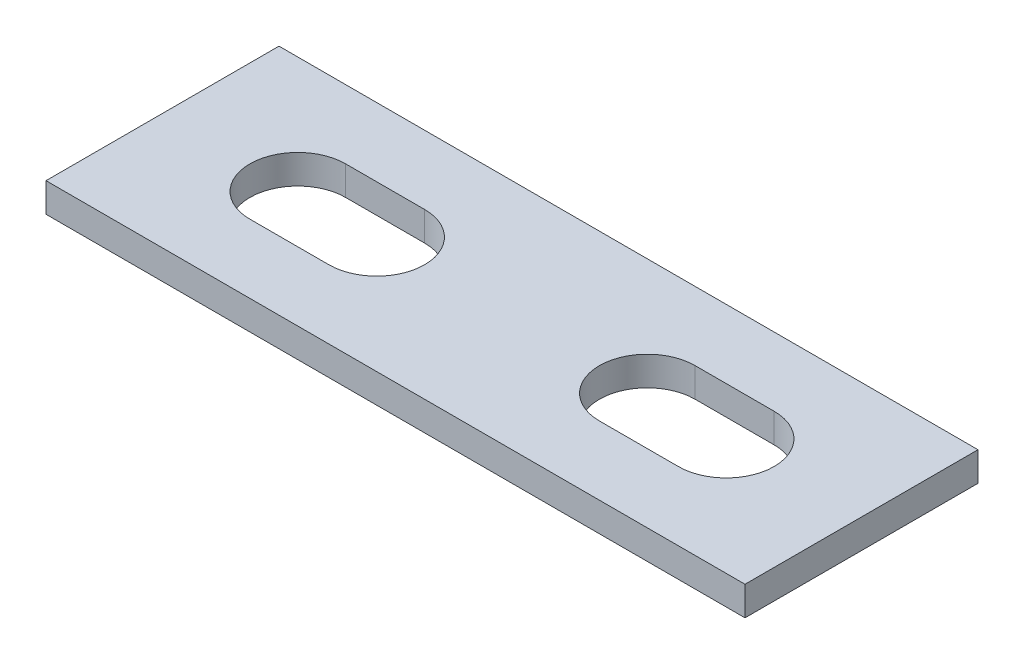
ISO-10303-21;
HEADER;
FILE_DESCRIPTION(('STEP AP214'),'2;1');
FILE_NAME('part.step','',(''),(''),'','','');
FILE_SCHEMA(('AUTOMOTIVE_DESIGN { 1 0 10303 214 1 1 1 1 }'));
ENDSEC;
DATA;
#1=APPLICATION_CONTEXT('core data for automotive mechanical design processes');
#2=APPLICATION_PROTOCOL_DEFINITION('international standard','automotive_design',2000,#1);
#3=PRODUCT_CONTEXT('',#1,'mechanical');
#4=PRODUCT('Part','Part','',(#3));
#5=PRODUCT_RELATED_PRODUCT_CATEGORY('part','',(#4));
#6=PRODUCT_DEFINITION_FORMATION('','',#4);
#7=PRODUCT_DEFINITION_CONTEXT('part definition',#1,'design');
#8=PRODUCT_DEFINITION('design','',#6,#7);
#9=PRODUCT_DEFINITION_SHAPE('','',#8);
#10=(LENGTH_UNIT() NAMED_UNIT(*) SI_UNIT(.MILLI.,.METRE.));
#11=(NAMED_UNIT(*) PLANE_ANGLE_UNIT() SI_UNIT($,.RADIAN.));
#12=(NAMED_UNIT(*) SI_UNIT($,.STERADIAN.) SOLID_ANGLE_UNIT());
#13=UNCERTAINTY_MEASURE_WITH_UNIT(LENGTH_MEASURE(1.E-05),#10,'distance_accuracy_value','');
#14=(GEOMETRIC_REPRESENTATION_CONTEXT(3) GLOBAL_UNCERTAINTY_ASSIGNED_CONTEXT((#13)) GLOBAL_UNIT_ASSIGNED_CONTEXT((#10,
#11,#12)) REPRESENTATION_CONTEXT('',''));
#15=CARTESIAN_POINT('',(0.,0.,0.));
#16=DIRECTION('',(0.,0.,1.));
#17=DIRECTION('',(1.,0.,0.));
#18=AXIS2_PLACEMENT_3D('',#15,#16,#17);
#19=CARTESIAN_POINT('',(0.,3.175,0.));
#20=DIRECTION('',(0.,1.,0.));
#21=DIRECTION('',(0.,0.,1.));
#22=AXIS2_PLACEMENT_3D('',#19,#20,#21);
#23=PLANE('',#22);
#24=DIRECTION('',(0.,0.,-1.));
#25=VECTOR('',#24,1.);
#26=CARTESIAN_POINT('',(38.1,3.175,-12.7));
#27=LINE('',#26,#25);
#28=CARTESIAN_POINT('',(38.1,3.175,12.7));
#29=VERTEX_POINT('',#28);
#30=CARTESIAN_POINT('',(38.1,3.175,-12.7));
#31=VERTEX_POINT('',#30);
#32=EDGE_CURVE('E193',#29,#31,#27,.T.);
#33=ORIENTED_EDGE('',*,*,#32,.T.);
#34=DIRECTION('',(-1.,0.,0.));
#35=VECTOR('',#34,1.);
#36=CARTESIAN_POINT('',(-38.1,3.175,-12.7));
#37=LINE('',#36,#35);
#38=CARTESIAN_POINT('',(-38.1,3.175,-12.7));
#39=VERTEX_POINT('',#38);
#40=EDGE_CURVE('E196',#31,#39,#37,.T.);
#41=ORIENTED_EDGE('',*,*,#40,.T.);
#42=DIRECTION('',(0.,0.,1.));
#43=VECTOR('',#42,1.);
#44=CARTESIAN_POINT('',(-38.1,3.175,-12.7));
#45=LINE('',#44,#43);
#46=CARTESIAN_POINT('',(-38.1,3.175,12.7));
#47=VERTEX_POINT('',#46);
#48=EDGE_CURVE('E199',#39,#47,#45,.T.);
#49=ORIENTED_EDGE('',*,*,#48,.T.);
#50=DIRECTION('',(1.,0.,0.));
#51=VECTOR('',#50,1.);
#52=CARTESIAN_POINT('',(-38.1,3.175,12.7));
#53=LINE('',#52,#51);
#54=EDGE_CURVE('E201',#47,#29,#53,.T.);
#55=ORIENTED_EDGE('',*,*,#54,.T.);
#56=EDGE_LOOP('',(#33,#41,#49,#55));
#57=FACE_BOUND('',#56,.T.);
#58=DIRECTION('',(1.,0.,0.));
#59=VECTOR('',#58,1.);
#60=CARTESIAN_POINT('',(-23.3553,3.175,5.2197));
#61=LINE('',#60,#59);
#62=CARTESIAN_POINT('',(-23.3553,3.175,5.2197));
#63=VERTEX_POINT('',#62);
#64=CARTESIAN_POINT('',(-14.7447,3.175,5.21970000000001));
#65=VERTEX_POINT('',#64);
#66=EDGE_CURVE('E164',#63,#65,#61,.T.);
#67=ORIENTED_EDGE('',*,*,#66,.F.);
#68=CARTESIAN_POINT('',(-23.3553,3.175,0.));
#69=DIRECTION('',(0.,1.,0.));
#70=DIRECTION('',(0.,0.,1.));
#71=AXIS2_PLACEMENT_3D('',#68,#69,#70);
#72=CIRCLE('',#71,5.2197);
#73=CARTESIAN_POINT('',(-23.3553,3.175,-5.2197));
#74=VERTEX_POINT('',#73);
#75=EDGE_CURVE('E162',#74,#63,#72,.T.);
#76=ORIENTED_EDGE('',*,*,#75,.F.);
#77=DIRECTION('',(-1.,0.,0.));
#78=VECTOR('',#77,1.);
#79=CARTESIAN_POINT('',(-23.3553,3.175,-5.2197));
#80=LINE('',#79,#78);
#81=CARTESIAN_POINT('',(-14.7447,3.175,-5.2197));
#82=VERTEX_POINT('',#81);
#83=EDGE_CURVE('E170',#82,#74,#80,.T.);
#84=ORIENTED_EDGE('',*,*,#83,.F.);
#85=CARTESIAN_POINT('',(-14.7447,3.175,0.));
#86=DIRECTION('',(0.,1.,0.));
#87=DIRECTION('',(0.,0.,1.));
#88=AXIS2_PLACEMENT_3D('',#85,#86,#87);
#89=CIRCLE('',#88,5.2197);
#90=EDGE_CURVE('E167',#65,#82,#89,.T.);
#91=ORIENTED_EDGE('',*,*,#90,.F.);
#92=EDGE_LOOP('',(#67,#76,#84,#91));
#93=FACE_BOUND('',#92,.T.);
#94=DIRECTION('',(-1.,0.,0.));
#95=VECTOR('',#94,1.);
#96=CARTESIAN_POINT('',(23.3553,3.175,-5.2197));
#97=LINE('',#96,#95);
#98=CARTESIAN_POINT('',(23.3553,3.175,-5.2197));
#99=VERTEX_POINT('',#98);
#100=CARTESIAN_POINT('',(14.7447,3.175,-5.2197));
#101=VERTEX_POINT('',#100);
#102=EDGE_CURVE('E134',#99,#101,#97,.T.);
#103=ORIENTED_EDGE('',*,*,#102,.F.);
#104=CARTESIAN_POINT('',(23.3553,3.175,0.));
#105=DIRECTION('',(0.,1.,0.));
#106=DIRECTION('',(0.,0.,-1.));
#107=AXIS2_PLACEMENT_3D('',#104,#105,#106);
#108=CIRCLE('',#107,5.2197);
#109=CARTESIAN_POINT('',(23.3553,3.175,5.2197));
#110=VERTEX_POINT('',#109);
#111=EDGE_CURVE('E126',#110,#99,#108,.T.);
#112=ORIENTED_EDGE('',*,*,#111,.F.);
#113=DIRECTION('',(1.,0.,0.));
#114=VECTOR('',#113,1.);
#115=CARTESIAN_POINT('',(23.3553,3.175,5.2197));
#116=LINE('',#115,#114);
#117=CARTESIAN_POINT('',(14.7447,3.175,5.2197));
#118=VERTEX_POINT('',#117);
#119=EDGE_CURVE('E148',#118,#110,#116,.T.);
#120=ORIENTED_EDGE('',*,*,#119,.F.);
#121=CARTESIAN_POINT('',(14.7447,3.175,0.));
#122=DIRECTION('',(0.,1.,0.));
#123=DIRECTION('',(0.,0.,-1.));
#124=AXIS2_PLACEMENT_3D('',#121,#122,#123);
#125=CIRCLE('',#124,5.2197);
#126=EDGE_CURVE('E146',#101,#118,#125,.T.);
#127=ORIENTED_EDGE('',*,*,#126,.F.);
#128=EDGE_LOOP('',(#103,#112,#120,#127));
#129=FACE_BOUND('',#128,.T.);
#130=ADVANCED_FACE('F37',(#57,#93,#129),#23,.T.);
#131=CARTESIAN_POINT('',(0.,0.,0.));
#132=DIRECTION('',(0.,1.,0.));
#133=DIRECTION('',(0.,0.,1.));
#134=AXIS2_PLACEMENT_3D('',#131,#132,#133);
#135=PLANE('',#134);
#136=CARTESIAN_POINT('',(-23.3553,0.,0.));
#137=DIRECTION('',(0.,1.,0.));
#138=DIRECTION('',(0.,0.,1.));
#139=AXIS2_PLACEMENT_3D('',#136,#137,#138);
#140=CIRCLE('',#139,5.2197);
#141=CARTESIAN_POINT('',(-23.3553,0.,-5.2197));
#142=VERTEX_POINT('',#141);
#143=CARTESIAN_POINT('',(-23.3553,0.,5.2197));
#144=VERTEX_POINT('',#143);
#145=EDGE_CURVE('E142',#142,#144,#140,.T.);
#146=ORIENTED_EDGE('',*,*,#145,.T.);
#147=DIRECTION('',(1.,0.,0.));
#148=VECTOR('',#147,1.);
#149=CARTESIAN_POINT('',(-23.3553,0.,5.2197));
#150=LINE('',#149,#148);
#151=CARTESIAN_POINT('',(-14.7447,0.,5.21970000000001));
#152=VERTEX_POINT('',#151);
#153=EDGE_CURVE('E175',#144,#152,#150,.T.);
#154=ORIENTED_EDGE('',*,*,#153,.T.);
#155=CARTESIAN_POINT('',(-14.7447,0.,0.));
#156=DIRECTION('',(0.,1.,0.));
#157=DIRECTION('',(0.,0.,1.));
#158=AXIS2_PLACEMENT_3D('',#155,#156,#157);
#159=CIRCLE('',#158,5.2197);
#160=CARTESIAN_POINT('',(-14.7447,0.,-5.2197));
#161=VERTEX_POINT('',#160);
#162=EDGE_CURVE('E178',#152,#161,#159,.T.);
#163=ORIENTED_EDGE('',*,*,#162,.T.);
#164=DIRECTION('',(-1.,0.,0.));
#165=VECTOR('',#164,1.);
#166=CARTESIAN_POINT('',(-23.3553,0.,-5.2197));
#167=LINE('',#166,#165);
#168=EDGE_CURVE('E165',#161,#142,#167,.T.);
#169=ORIENTED_EDGE('',*,*,#168,.T.);
#170=EDGE_LOOP('',(#146,#154,#163,#169));
#171=FACE_BOUND('',#170,.T.);
#172=DIRECTION('',(0.,0.,-1.));
#173=VECTOR('',#172,1.);
#174=CARTESIAN_POINT('',(38.1,0.,-12.7));
#175=LINE('',#174,#173);
#176=CARTESIAN_POINT('',(38.1,0.,12.7));
#177=VERTEX_POINT('',#176);
#178=CARTESIAN_POINT('',(38.1,0.,-12.7));
#179=VERTEX_POINT('',#178);
#180=EDGE_CURVE('E192',#177,#179,#175,.T.);
#181=ORIENTED_EDGE('',*,*,#180,.F.);
#182=DIRECTION('',(1.,0.,0.));
#183=VECTOR('',#182,1.);
#184=CARTESIAN_POINT('',(-38.1,0.,12.7));
#185=LINE('',#184,#183);
#186=CARTESIAN_POINT('',(-38.1,0.,12.7));
#187=VERTEX_POINT('',#186);
#188=EDGE_CURVE('E197',#187,#177,#185,.T.);
#189=ORIENTED_EDGE('',*,*,#188,.F.);
#190=DIRECTION('',(0.,0.,1.));
#191=VECTOR('',#190,1.);
#192=CARTESIAN_POINT('',(-38.1,0.,-12.7));
#193=LINE('',#192,#191);
#194=CARTESIAN_POINT('',(-38.1,0.,-12.7));
#195=VERTEX_POINT('',#194);
#196=EDGE_CURVE('E208',#195,#187,#193,.T.);
#197=ORIENTED_EDGE('',*,*,#196,.F.);
#198=DIRECTION('',(-1.,0.,0.));
#199=VECTOR('',#198,1.);
#200=CARTESIAN_POINT('',(-38.1,0.,-12.7));
#201=LINE('',#200,#199);
#202=EDGE_CURVE('E206',#179,#195,#201,.T.);
#203=ORIENTED_EDGE('',*,*,#202,.F.);
#204=EDGE_LOOP('',(#181,#189,#197,#203));
#205=FACE_BOUND('',#204,.T.);
#206=CARTESIAN_POINT('',(23.3553,0.,0.));
#207=DIRECTION('',(0.,1.,0.));
#208=DIRECTION('',(0.,0.,-1.));
#209=AXIS2_PLACEMENT_3D('',#206,#207,#208);
#210=CIRCLE('',#209,5.2197);
#211=CARTESIAN_POINT('',(23.3553,0.,5.2197));
#212=VERTEX_POINT('',#211);
#213=CARTESIAN_POINT('',(23.3553,0.,-5.2197));
#214=VERTEX_POINT('',#213);
#215=EDGE_CURVE('E60',#212,#214,#210,.T.);
#216=ORIENTED_EDGE('',*,*,#215,.T.);
#217=DIRECTION('',(-1.,0.,0.));
#218=VECTOR('',#217,1.);
#219=CARTESIAN_POINT('',(23.3553,0.,-5.2197));
#220=LINE('',#219,#218);
#221=CARTESIAN_POINT('',(14.7447,0.,-5.2197));
#222=VERTEX_POINT('',#221);
#223=EDGE_CURVE('E141',#214,#222,#220,.T.);
#224=ORIENTED_EDGE('',*,*,#223,.T.);
#225=CARTESIAN_POINT('',(14.7447,0.,0.));
#226=DIRECTION('',(0.,1.,0.));
#227=DIRECTION('',(0.,0.,-1.));
#228=AXIS2_PLACEMENT_3D('',#225,#226,#227);
#229=CIRCLE('',#228,5.2197);
#230=CARTESIAN_POINT('',(14.7447,0.,5.2197));
#231=VERTEX_POINT('',#230);
#232=EDGE_CURVE('E154',#222,#231,#229,.T.);
#233=ORIENTED_EDGE('',*,*,#232,.T.);
#234=DIRECTION('',(1.,0.,0.));
#235=VECTOR('',#234,1.);
#236=CARTESIAN_POINT('',(23.3553,0.,5.2197));
#237=LINE('',#236,#235);
#238=EDGE_CURVE('E135',#231,#212,#237,.T.);
#239=ORIENTED_EDGE('',*,*,#238,.T.);
#240=EDGE_LOOP('',(#216,#224,#233,#239));
#241=FACE_BOUND('',#240,.T.);
#242=ADVANCED_FACE('F226',(#171,#205,#241),#135,.F.);
#243=CARTESIAN_POINT('',(38.1,3.175,-12.7));
#244=DIRECTION('',(-1.,0.,0.));
#245=DIRECTION('',(0.,0.,1.));
#246=AXIS2_PLACEMENT_3D('',#243,#244,#245);
#247=PLANE('',#246);
#248=ORIENTED_EDGE('',*,*,#180,.T.);
#249=DIRECTION('',(0.,-1.,0.));
#250=VECTOR('',#249,1.);
#251=CARTESIAN_POINT('',(38.1,3.175,-12.7));
#252=LINE('',#251,#250);
#253=EDGE_CURVE('E11',#31,#179,#252,.T.);
#254=ORIENTED_EDGE('',*,*,#253,.F.);
#255=ORIENTED_EDGE('',*,*,#32,.F.);
#256=DIRECTION('',(0.,-1.,0.));
#257=VECTOR('',#256,1.);
#258=CARTESIAN_POINT('',(38.1,3.175,12.7));
#259=LINE('',#258,#257);
#260=EDGE_CURVE('E203',#29,#177,#259,.T.);
#261=ORIENTED_EDGE('',*,*,#260,.T.);
#262=EDGE_LOOP('',(#248,#254,#255,#261));
#263=FACE_BOUND('',#262,.T.);
#264=ADVANCED_FACE('F39',(#263),#247,.F.);
#265=CARTESIAN_POINT('',(-38.1,3.175,-12.7));
#266=DIRECTION('',(0.,0.,1.));
#267=DIRECTION('',(1.,0.,0.));
#268=AXIS2_PLACEMENT_3D('',#265,#266,#267);
#269=PLANE('',#268);
#270=ORIENTED_EDGE('',*,*,#202,.T.);
#271=DIRECTION('',(0.,-1.,0.));
#272=VECTOR('',#271,1.);
#273=CARTESIAN_POINT('',(-38.1,3.175,-12.7));
#274=LINE('',#273,#272);
#275=EDGE_CURVE('E45',#39,#195,#274,.T.);
#276=ORIENTED_EDGE('',*,*,#275,.F.);
#277=ORIENTED_EDGE('',*,*,#40,.F.);
#278=ORIENTED_EDGE('',*,*,#253,.T.);
#279=EDGE_LOOP('',(#270,#276,#277,#278));
#280=FACE_BOUND('',#279,.T.);
#281=ADVANCED_FACE('F237',(#280),#269,.F.);
#282=CARTESIAN_POINT('',(-38.1,3.175,-12.7));
#283=DIRECTION('',(1.,0.,0.));
#284=DIRECTION('',(0.,0.,-1.));
#285=AXIS2_PLACEMENT_3D('',#282,#283,#284);
#286=PLANE('',#285);
#287=ORIENTED_EDGE('',*,*,#196,.T.);
#288=DIRECTION('',(0.,-1.,0.));
#289=VECTOR('',#288,1.);
#290=CARTESIAN_POINT('',(-38.1,3.175,12.7));
#291=LINE('',#290,#289);
#292=EDGE_CURVE('E213',#47,#187,#291,.T.);
#293=ORIENTED_EDGE('',*,*,#292,.F.);
#294=ORIENTED_EDGE('',*,*,#48,.F.);
#295=ORIENTED_EDGE('',*,*,#275,.T.);
#296=EDGE_LOOP('',(#287,#293,#294,#295));
#297=FACE_BOUND('',#296,.T.);
#298=ADVANCED_FACE('F220',(#297),#286,.F.);
#299=CARTESIAN_POINT('',(-38.1,3.175,12.7));
#300=DIRECTION('',(0.,0.,-1.));
#301=DIRECTION('',(-1.,0.,0.));
#302=AXIS2_PLACEMENT_3D('',#299,#300,#301);
#303=PLANE('',#302);
#304=ORIENTED_EDGE('',*,*,#188,.T.);
#305=ORIENTED_EDGE('',*,*,#260,.F.);
#306=ORIENTED_EDGE('',*,*,#54,.F.);
#307=ORIENTED_EDGE('',*,*,#292,.T.);
#308=EDGE_LOOP('',(#304,#305,#306,#307));
#309=FACE_BOUND('',#308,.T.);
#310=ADVANCED_FACE('F230',(#309),#303,.F.);
#311=CARTESIAN_POINT('',(-23.3553,3.175,0.));
#312=DIRECTION('',(0.,-1.,0.));
#313=DIRECTION('',(0.,0.,-1.));
#314=AXIS2_PLACEMENT_3D('',#311,#312,#313);
#315=CYLINDRICAL_SURFACE('',#314,5.2197);
#316=ORIENTED_EDGE('',*,*,#145,.F.);
#317=DIRECTION('',(0.,-1.,0.));
#318=VECTOR('',#317,1.);
#319=CARTESIAN_POINT('',(-23.3553,3.175,-5.2197));
#320=LINE('',#319,#318);
#321=EDGE_CURVE('E172',#74,#142,#320,.T.);
#322=ORIENTED_EDGE('',*,*,#321,.F.);
#323=ORIENTED_EDGE('',*,*,#75,.T.);
#324=DIRECTION('',(0.,-1.,0.));
#325=VECTOR('',#324,1.);
#326=CARTESIAN_POINT('',(-23.3553,3.175,5.2197));
#327=LINE('',#326,#325);
#328=EDGE_CURVE('E189',#63,#144,#327,.T.);
#329=ORIENTED_EDGE('',*,*,#328,.T.);
#330=EDGE_LOOP('',(#316,#322,#323,#329));
#331=FACE_BOUND('',#330,.T.);
#332=ADVANCED_FACE('F252',(#331),#315,.F.);
#333=CARTESIAN_POINT('',(-23.3553,3.175,5.2197));
#334=DIRECTION('',(0.,0.,-1.));
#335=DIRECTION('',(-1.,0.,0.));
#336=AXIS2_PLACEMENT_3D('',#333,#334,#335);
#337=PLANE('',#336);
#338=ORIENTED_EDGE('',*,*,#153,.F.);
#339=ORIENTED_EDGE('',*,*,#328,.F.);
#340=ORIENTED_EDGE('',*,*,#66,.T.);
#341=DIRECTION('',(0.,-1.,0.));
#342=VECTOR('',#341,1.);
#343=CARTESIAN_POINT('',(-14.7447,3.175,5.21970000000001));
#344=LINE('',#343,#342);
#345=EDGE_CURVE('E187',#65,#152,#344,.T.);
#346=ORIENTED_EDGE('',*,*,#345,.T.);
#347=EDGE_LOOP('',(#338,#339,#340,#346));
#348=FACE_BOUND('',#347,.T.);
#349=ADVANCED_FACE('F259',(#348),#337,.T.);
#350=CARTESIAN_POINT('',(-14.7447,3.175,0.));
#351=DIRECTION('',(0.,-1.,0.));
#352=DIRECTION('',(0.,0.,-1.));
#353=AXIS2_PLACEMENT_3D('',#350,#351,#352);
#354=CYLINDRICAL_SURFACE('',#353,5.2197);
#355=ORIENTED_EDGE('',*,*,#162,.F.);
#356=ORIENTED_EDGE('',*,*,#345,.F.);
#357=ORIENTED_EDGE('',*,*,#90,.T.);
#358=DIRECTION('',(0.,-1.,0.));
#359=VECTOR('',#358,1.);
#360=CARTESIAN_POINT('',(-14.7447,3.175,-5.2197));
#361=LINE('',#360,#359);
#362=EDGE_CURVE('E185',#82,#161,#361,.T.);
#363=ORIENTED_EDGE('',*,*,#362,.T.);
#364=EDGE_LOOP('',(#355,#356,#357,#363));
#365=FACE_BOUND('',#364,.T.);
#366=ADVANCED_FACE('F264',(#365),#354,.F.);
#367=CARTESIAN_POINT('',(-23.3553,3.175,-5.2197));
#368=DIRECTION('',(0.,0.,1.));
#369=DIRECTION('',(1.,0.,0.));
#370=AXIS2_PLACEMENT_3D('',#367,#368,#369);
#371=PLANE('',#370);
#372=ORIENTED_EDGE('',*,*,#168,.F.);
#373=ORIENTED_EDGE('',*,*,#362,.F.);
#374=ORIENTED_EDGE('',*,*,#83,.T.);
#375=ORIENTED_EDGE('',*,*,#321,.T.);
#376=EDGE_LOOP('',(#372,#373,#374,#375));
#377=FACE_BOUND('',#376,.T.);
#378=ADVANCED_FACE('F271',(#377),#371,.T.);
#379=CARTESIAN_POINT('',(23.3553,3.175,0.));
#380=DIRECTION('',(0.,-1.,0.));
#381=DIRECTION('',(0.,0.,-1.));
#382=AXIS2_PLACEMENT_3D('',#379,#380,#381);
#383=CYLINDRICAL_SURFACE('',#382,5.2197);
#384=ORIENTED_EDGE('',*,*,#215,.F.);
#385=DIRECTION('',(0.,-1.,0.));
#386=VECTOR('',#385,1.);
#387=CARTESIAN_POINT('',(23.3553,3.175,5.2197));
#388=LINE('',#387,#386);
#389=EDGE_CURVE('E130',#110,#212,#388,.T.);
#390=ORIENTED_EDGE('',*,*,#389,.F.);
#391=ORIENTED_EDGE('',*,*,#111,.T.);
#392=DIRECTION('',(0.,-1.,0.));
#393=VECTOR('',#392,1.);
#394=CARTESIAN_POINT('',(23.3553,3.175,-5.2197));
#395=LINE('',#394,#393);
#396=EDGE_CURVE('E129',#99,#214,#395,.T.);
#397=ORIENTED_EDGE('',*,*,#396,.T.);
#398=EDGE_LOOP('',(#384,#390,#391,#397));
#399=FACE_BOUND('',#398,.T.);
#400=ADVANCED_FACE('F128',(#399),#383,.F.);
#401=CARTESIAN_POINT('',(23.3553,3.175,-5.2197));
#402=DIRECTION('',(0.,0.,1.));
#403=DIRECTION('',(1.,0.,0.));
#404=AXIS2_PLACEMENT_3D('',#401,#402,#403);
#405=PLANE('',#404);
#406=ORIENTED_EDGE('',*,*,#223,.F.);
#407=ORIENTED_EDGE('',*,*,#396,.F.);
#408=ORIENTED_EDGE('',*,*,#102,.T.);
#409=DIRECTION('',(0.,-1.,0.));
#410=VECTOR('',#409,1.);
#411=CARTESIAN_POINT('',(14.7447,3.175,-5.2197));
#412=LINE('',#411,#410);
#413=EDGE_CURVE('E143',#101,#222,#412,.T.);
#414=ORIENTED_EDGE('',*,*,#413,.T.);
#415=EDGE_LOOP('',(#406,#407,#408,#414));
#416=FACE_BOUND('',#415,.T.);
#417=ADVANCED_FACE('F138',(#416),#405,.T.);
#418=CARTESIAN_POINT('',(14.7447,3.175,0.));
#419=DIRECTION('',(0.,-1.,0.));
#420=DIRECTION('',(0.,0.,-1.));
#421=AXIS2_PLACEMENT_3D('',#418,#419,#420);
#422=CYLINDRICAL_SURFACE('',#421,5.2197);
#423=ORIENTED_EDGE('',*,*,#232,.F.);
#424=ORIENTED_EDGE('',*,*,#413,.F.);
#425=ORIENTED_EDGE('',*,*,#126,.T.);
#426=DIRECTION('',(0.,-1.,0.));
#427=VECTOR('',#426,1.);
#428=CARTESIAN_POINT('',(14.7447,3.175,5.2197));
#429=LINE('',#428,#427);
#430=EDGE_CURVE('E52',#118,#231,#429,.T.);
#431=ORIENTED_EDGE('',*,*,#430,.T.);
#432=EDGE_LOOP('',(#423,#424,#425,#431));
#433=FACE_BOUND('',#432,.T.);
#434=ADVANCED_FACE('F289',(#433),#422,.F.);
#435=CARTESIAN_POINT('',(23.3553,3.175,5.2197));
#436=DIRECTION('',(0.,0.,-1.));
#437=DIRECTION('',(-1.,0.,0.));
#438=AXIS2_PLACEMENT_3D('',#435,#436,#437);
#439=PLANE('',#438);
#440=ORIENTED_EDGE('',*,*,#238,.F.);
#441=ORIENTED_EDGE('',*,*,#430,.F.);
#442=ORIENTED_EDGE('',*,*,#119,.T.);
#443=ORIENTED_EDGE('',*,*,#389,.T.);
#444=EDGE_LOOP('',(#440,#441,#442,#443));
#445=FACE_BOUND('',#444,.T.);
#446=ADVANCED_FACE('F292',(#445),#439,.T.);
#447=CLOSED_SHELL('',(#130,#242,#264,#281,#298,#310,#332,#349,#366,#378,#400,#417,#434,#446));
#448=MANIFOLD_SOLID_BREP('B2',#447);
#449=ADVANCED_BREP_SHAPE_REPRESENTATION('',(#18,#448),#14);
#450=SHAPE_DEFINITION_REPRESENTATION(#9,#449);
ENDSEC;
END-ISO-10303-21;
